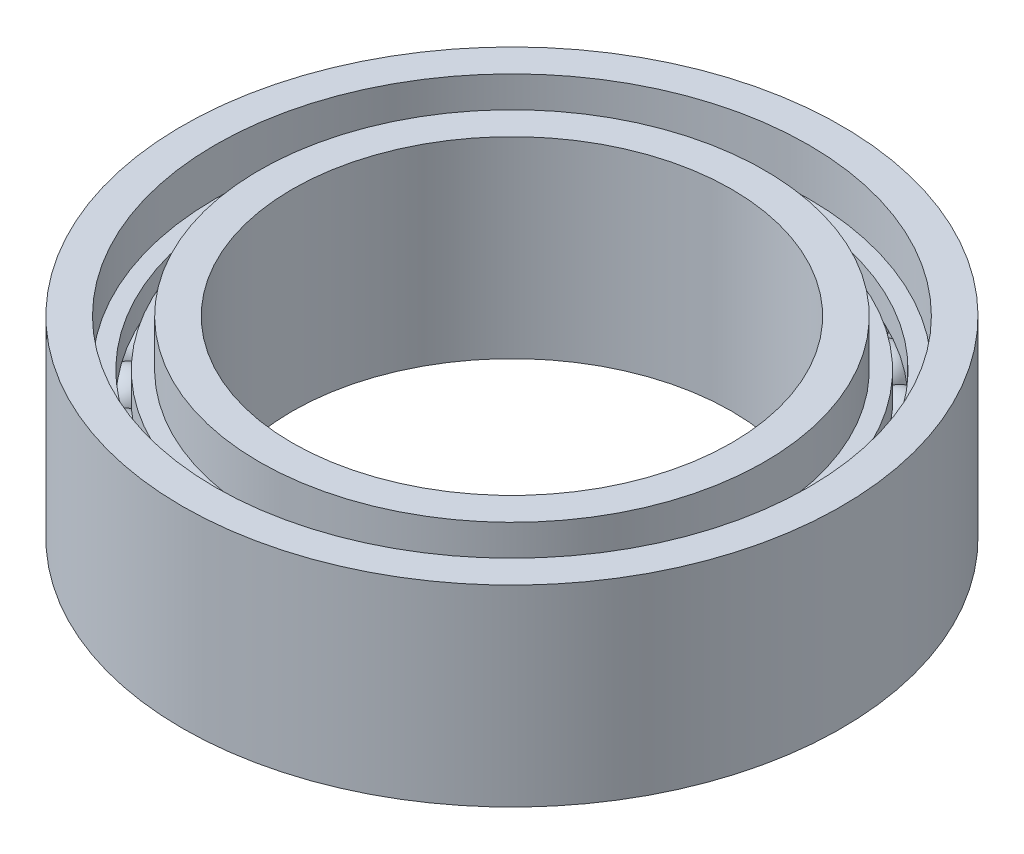
ISO-10303-21;
HEADER;
FILE_DESCRIPTION(('STEP AP214'),'2;1');
FILE_NAME('part.step','',(''),(''),'','','');
FILE_SCHEMA(('AUTOMOTIVE_DESIGN { 1 0 10303 214 1 1 1 1 }'));
ENDSEC;
DATA;
#1=APPLICATION_CONTEXT('core data for automotive mechanical design processes');
#2=APPLICATION_PROTOCOL_DEFINITION('international standard','automotive_design',2000,#1);
#3=PRODUCT_CONTEXT('',#1,'mechanical');
#4=PRODUCT('Part','Part','',(#3));
#5=PRODUCT_RELATED_PRODUCT_CATEGORY('part','',(#4));
#6=PRODUCT_DEFINITION_FORMATION('','',#4);
#7=PRODUCT_DEFINITION_CONTEXT('part definition',#1,'design');
#8=PRODUCT_DEFINITION('design','',#6,#7);
#9=PRODUCT_DEFINITION_SHAPE('','',#8);
#10=(LENGTH_UNIT() NAMED_UNIT(*) SI_UNIT(.MILLI.,.METRE.));
#11=(NAMED_UNIT(*) PLANE_ANGLE_UNIT() SI_UNIT($,.RADIAN.));
#12=(NAMED_UNIT(*) SI_UNIT($,.STERADIAN.) SOLID_ANGLE_UNIT());
#13=UNCERTAINTY_MEASURE_WITH_UNIT(LENGTH_MEASURE(1.E-05),#10,'distance_accuracy_value','');
#14=(GEOMETRIC_REPRESENTATION_CONTEXT(3) GLOBAL_UNCERTAINTY_ASSIGNED_CONTEXT((#13)) GLOBAL_UNIT_ASSIGNED_CONTEXT((#10,
#11,#12)) REPRESENTATION_CONTEXT('',''));
#15=CARTESIAN_POINT('',(0.,0.,0.));
#16=DIRECTION('',(0.,0.,1.));
#17=DIRECTION('',(1.,0.,0.));
#18=AXIS2_PLACEMENT_3D('',#15,#16,#17);
#19=CARTESIAN_POINT('',(-4.89073800366904,1.75,1.03955845408873));
#20=DIRECTION('',(-0.978147600733808,0.,0.207911690817747));
#21=DIRECTION('',(-0.207911690817747,0.,-0.978147600733808));
#22=AXIS2_PLACEMENT_3D('',#19,#20,#21);
#23=SPHERICAL_SURFACE('',#22,0.4);
#24=CARTESIAN_POINT('',(-5.28199704396257,1.75,1.12272313041583));
#25=VERTEX_POINT('',#24);
#26=VERTEX_LOOP('',#25);
#27=FACE_BOUND('',#26,.T.);
#28=ADVANCED_FACE('F63',(#27),#23,.T.);
#29=CLOSED_SHELL('',(#28));
#30=MANIFOLD_SOLID_BREP('B2',#29);
#31=CARTESIAN_POINT('',(-4.56772728821303,1.75,2.03368321537894));
#32=DIRECTION('',(-0.913545457642606,0.,0.406736643075789));
#33=DIRECTION('',(-0.406736643075789,0.,-0.913545457642606));
#34=AXIS2_PLACEMENT_3D('',#31,#32,#33);
#35=SPHERICAL_SURFACE('',#34,0.4);
#36=CARTESIAN_POINT('',(-4.93314547127008,1.75,2.19637787260926));
#37=VERTEX_POINT('',#36);
#38=VERTEX_LOOP('',#37);
#39=FACE_BOUND('',#38,.T.);
#40=ADVANCED_FACE('F83',(#39),#35,.T.);
#41=CLOSED_SHELL('',(#40));
#42=MANIFOLD_SOLID_BREP('B7',#41);
#43=CARTESIAN_POINT('',(-4.04508497187477,1.75,2.93892626146232));
#44=DIRECTION('',(-0.809016994374955,0.,0.587785252292463));
#45=DIRECTION('',(-0.587785252292463,0.,-0.809016994374955));
#46=AXIS2_PLACEMENT_3D('',#43,#44,#45);
#47=SPHERICAL_SURFACE('',#46,0.4);
#48=CARTESIAN_POINT('',(-4.36869176962476,1.75,3.1740403623793));
#49=VERTEX_POINT('',#48);
#50=VERTEX_LOOP('',#49);
#51=FACE_BOUND('',#50,.T.);
#52=ADVANCED_FACE('F103',(#51),#47,.T.);
#53=CLOSED_SHELL('',(#52));
#54=MANIFOLD_SOLID_BREP('B59',#53);
#55=CARTESIAN_POINT('',(-3.34565303179434,1.75,3.71572412738693));
#56=DIRECTION('',(-0.669130606358867,0.,0.743144825477386));
#57=DIRECTION('',(-0.743144825477386,0.,-0.669130606358867));
#58=AXIS2_PLACEMENT_3D('',#55,#56,#57);
#59=SPHERICAL_SURFACE('',#58,0.4);
#60=CARTESIAN_POINT('',(-3.61330527433788,1.75,4.01298205757789));
#61=VERTEX_POINT('',#60);
#62=VERTEX_LOOP('',#61);
#63=FACE_BOUND('',#62,.T.);
#64=ADVANCED_FACE('F123',(#63),#59,.T.);
#65=CLOSED_SHELL('',(#64));
#66=MANIFOLD_SOLID_BREP('B79',#65);
#67=CARTESIAN_POINT('',(-2.50000000000005,1.75,4.33012701892216));
#68=DIRECTION('',(-0.50000000000001,0.,0.866025403784433));
#69=DIRECTION('',(-0.866025403784433,0.,-0.50000000000001));
#70=AXIS2_PLACEMENT_3D('',#67,#68,#69);
#71=SPHERICAL_SURFACE('',#70,0.4);
#72=CARTESIAN_POINT('',(-2.70000000000006,1.75,4.67653718043594));
#73=VERTEX_POINT('',#72);
#74=VERTEX_LOOP('',#73);
#75=FACE_BOUND('',#74,.T.);
#76=ADVANCED_FACE('F143',(#75),#71,.T.);
#77=CLOSED_SHELL('',(#76));
#78=MANIFOLD_SOLID_BREP('B99',#77);
#79=CARTESIAN_POINT('',(-1.54508497187479,1.75,4.75528258147575));
#80=DIRECTION('',(-0.309016994374957,0.,0.95105651629515));
#81=DIRECTION('',(-0.95105651629515,0.,-0.309016994374957));
#82=AXIS2_PLACEMENT_3D('',#79,#80,#81);
#83=SPHERICAL_SURFACE('',#82,0.4);
#84=CARTESIAN_POINT('',(-1.66869176962477,1.75,5.13570518799381));
#85=VERTEX_POINT('',#84);
#86=VERTEX_LOOP('',#85);
#87=FACE_BOUND('',#86,.T.);
#88=ADVANCED_FACE('F163',(#87),#83,.T.);
#89=CLOSED_SHELL('',(#88));
#90=MANIFOLD_SOLID_BREP('B119',#89);
#91=CARTESIAN_POINT('',(-0.522642316338318,1.75,4.97260947684136));
#92=DIRECTION('',(-0.104528463267664,0.,0.994521895368272));
#93=DIRECTION('',(-0.994521895368272,0.,-0.104528463267664));
#94=AXIS2_PLACEMENT_3D('',#91,#92,#93);
#95=SPHERICAL_SURFACE('',#94,0.4);
#96=CARTESIAN_POINT('',(-0.564453701645384,1.75,5.37041823498867));
#97=VERTEX_POINT('',#96);
#98=VERTEX_LOOP('',#97);
#99=FACE_BOUND('',#98,.T.);
#100=ADVANCED_FACE('F183',(#99),#95,.T.);
#101=CLOSED_SHELL('',(#100));
#102=MANIFOLD_SOLID_BREP('B139',#101);
#103=CARTESIAN_POINT('',(0.522642316338218,1.75,4.97260947684137));
#104=DIRECTION('',(0.104528463267644,0.,0.994521895368274));
#105=DIRECTION('',(-0.994521895368274,0.,0.104528463267644));
#106=AXIS2_PLACEMENT_3D('',#103,#104,#105);
#107=SPHERICAL_SURFACE('',#106,0.4);
#108=CARTESIAN_POINT('',(0.564453701645276,1.75,5.37041823498868));
#109=VERTEX_POINT('',#108);
#110=VERTEX_LOOP('',#109);
#111=FACE_BOUND('',#110,.T.);
#112=ADVANCED_FACE('F203',(#111),#107,.T.);
#113=CLOSED_SHELL('',(#112));
#114=MANIFOLD_SOLID_BREP('B159',#113);
#115=CARTESIAN_POINT('',(1.54508497187469,1.75,4.75528258147578));
#116=DIRECTION('',(0.309016994374938,0.,0.951056516295157));
#117=DIRECTION('',(-0.951056516295157,0.,0.309016994374938));
#118=AXIS2_PLACEMENT_3D('',#115,#116,#117);
#119=SPHERICAL_SURFACE('',#118,0.4);
#120=CARTESIAN_POINT('',(1.66869176962467,1.75,5.13570518799385));
#121=VERTEX_POINT('',#120);
#122=VERTEX_LOOP('',#121);
#123=FACE_BOUND('',#122,.T.);
#124=ADVANCED_FACE('F223',(#123),#119,.T.);
#125=CLOSED_SHELL('',(#124));
#126=MANIFOLD_SOLID_BREP('B179',#125);
#127=CARTESIAN_POINT('',(2.49999999999996,1.75,4.33012701892222));
#128=DIRECTION('',(0.499999999999992,0.,0.866025403784443));
#129=DIRECTION('',(-0.866025403784443,0.,0.499999999999992));
#130=AXIS2_PLACEMENT_3D('',#127,#128,#129);
#131=SPHERICAL_SURFACE('',#130,0.4);
#132=CARTESIAN_POINT('',(2.69999999999996,1.75,4.67653718043599));
#133=VERTEX_POINT('',#132);
#134=VERTEX_LOOP('',#133);
#135=FACE_BOUND('',#134,.T.);
#136=ADVANCED_FACE('F243',(#135),#131,.T.);
#137=CLOSED_SHELL('',(#136));
#138=MANIFOLD_SOLID_BREP('B199',#137);
#139=CARTESIAN_POINT('',(3.34565303179426,1.75,3.715724127387));
#140=DIRECTION('',(0.669130606358852,0.,0.7431448254774));
#141=DIRECTION('',(-0.7431448254774,0.,0.669130606358852));
#142=AXIS2_PLACEMENT_3D('',#139,#140,#141);
#143=SPHERICAL_SURFACE('',#142,0.4);
#144=CARTESIAN_POINT('',(3.6133052743378,1.75,4.01298205757796));
#145=VERTEX_POINT('',#144);
#146=VERTEX_LOOP('',#145);
#147=FACE_BOUND('',#146,.T.);
#148=ADVANCED_FACE('F263',(#147),#143,.T.);
#149=CLOSED_SHELL('',(#148));
#150=MANIFOLD_SOLID_BREP('B219',#149);
#151=CARTESIAN_POINT('',(4.04508497187471,1.75,2.9389262614624));
#152=DIRECTION('',(0.809016994374943,0.,0.58778525229248));
#153=DIRECTION('',(-0.58778525229248,0.,0.809016994374943));
#154=AXIS2_PLACEMENT_3D('',#151,#152,#153);
#155=SPHERICAL_SURFACE('',#154,0.4);
#156=CARTESIAN_POINT('',(4.36869176962469,1.75,3.17404036237939));
#157=VERTEX_POINT('',#156);
#158=VERTEX_LOOP('',#157);
#159=FACE_BOUND('',#158,.T.);
#160=ADVANCED_FACE('F285',(#159),#155,.T.);
#161=CLOSED_SHELL('',(#160));
#162=MANIFOLD_SOLID_BREP('B239',#161);
#163=CARTESIAN_POINT('',(4.56772728821299,1.75,2.03368321537904));
#164=DIRECTION('',(0.913545457642598,0.,0.406736643075807));
#165=DIRECTION('',(-0.406736643075807,0.,0.913545457642598));
#166=AXIS2_PLACEMENT_3D('',#163,#164,#165);
#167=SPHERICAL_SURFACE('',#166,0.4);
#168=CARTESIAN_POINT('',(4.20230910515595,1.75,1.87098855814871));
#169=VERTEX_POINT('',#168);
#170=VERTEX_LOOP('',#169);
#171=FACE_BOUND('',#170,.T.);
#172=CARTESIAN_POINT('',(4.93314547127003,1.75,2.19637787260936));
#173=VERTEX_POINT('',#172);
#174=VERTEX_LOOP('',#173);
#175=FACE_BOUND('',#174,.T.);
#176=ADVANCED_FACE('F307',(#171,#175),#167,.T.);
#177=CLOSED_SHELL('',(#176));
#178=MANIFOLD_SOLID_BREP('B259',#177);
#179=CARTESIAN_POINT('',(4.89073800366902,1.75,1.03955845408883));
#180=DIRECTION('',(0.978147600733804,0.,0.207911690817766));
#181=DIRECTION('',(-0.207911690817766,0.,0.978147600733804));
#182=AXIS2_PLACEMENT_3D('',#179,#180,#181);
#183=SPHERICAL_SURFACE('',#182,0.4);
#184=CARTESIAN_POINT('',(4.4994789633755,1.75,0.956393777761726));
#185=VERTEX_POINT('',#184);
#186=VERTEX_LOOP('',#185);
#187=FACE_BOUND('',#186,.T.);
#188=CARTESIAN_POINT('',(5.28199704396254,1.75,1.12272313041594));
#189=VERTEX_POINT('',#188);
#190=VERTEX_LOOP('',#189);
#191=FACE_BOUND('',#190,.T.);
#192=ADVANCED_FACE('F335',(#187,#191),#183,.T.);
#193=CLOSED_SHELL('',(#192));
#194=MANIFOLD_SOLID_BREP('B279',#193);
#195=CARTESIAN_POINT('',(5.,1.75,0.));
#196=DIRECTION('',(1.,0.,0.));
#197=DIRECTION('',(0.,0.,1.));
#198=AXIS2_PLACEMENT_3D('',#195,#196,#197);
#199=SPHERICAL_SURFACE('',#198,0.4);
#200=CARTESIAN_POINT('',(4.6,1.75,0.));
#201=VERTEX_POINT('',#200);
#202=VERTEX_LOOP('',#201);
#203=FACE_BOUND('',#202,.T.);
#204=CARTESIAN_POINT('',(5.4,1.75,0.));
#205=VERTEX_POINT('',#204);
#206=VERTEX_LOOP('',#205);
#207=FACE_BOUND('',#206,.T.);
#208=ADVANCED_FACE('F363',(#203,#207),#199,.T.);
#209=CLOSED_SHELL('',(#208));
#210=MANIFOLD_SOLID_BREP('B301',#209);
#211=CARTESIAN_POINT('',(4.89073800366903,1.75,-1.03955845408877));
#212=DIRECTION('',(0.978147600733807,0.,-0.207911690817753));
#213=DIRECTION('',(0.207911690817753,0.,0.978147600733807));
#214=AXIS2_PLACEMENT_3D('',#211,#212,#213);
#215=SPHERICAL_SURFACE('',#214,0.4);
#216=CARTESIAN_POINT('',(4.49947896337551,1.75,-0.956393777761665));
#217=VERTEX_POINT('',#216);
#218=VERTEX_LOOP('',#217);
#219=FACE_BOUND('',#218,.T.);
#220=CARTESIAN_POINT('',(5.28199704396256,1.75,-1.12272313041587));
#221=VERTEX_POINT('',#220);
#222=VERTEX_LOOP('',#221);
#223=FACE_BOUND('',#222,.T.);
#224=ADVANCED_FACE('F391',(#219,#223),#215,.T.);
#225=CLOSED_SHELL('',(#224));
#226=MANIFOLD_SOLID_BREP('B329',#225);
#227=CARTESIAN_POINT('',(4.56772728821302,1.75,-2.03368321537897));
#228=DIRECTION('',(0.913545457642603,0.,-0.406736643075795));
#229=DIRECTION('',(0.406736643075795,0.,0.913545457642603));
#230=AXIS2_PLACEMENT_3D('',#227,#228,#229);
#231=SPHERICAL_SURFACE('',#230,0.4);
#232=CARTESIAN_POINT('',(4.20230910515598,1.75,-1.87098855814866));
#233=VERTEX_POINT('',#232);
#234=VERTEX_LOOP('',#233);
#235=FACE_BOUND('',#234,.T.);
#236=CARTESIAN_POINT('',(4.93314547127006,1.75,-2.19637787260929));
#237=VERTEX_POINT('',#236);
#238=VERTEX_LOOP('',#237);
#239=FACE_BOUND('',#238,.T.);
#240=ADVANCED_FACE('F419',(#235,#239),#231,.T.);
#241=CLOSED_SHELL('',(#240));
#242=MANIFOLD_SOLID_BREP('B357',#241);
#243=CARTESIAN_POINT('',(4.04508497187475,1.75,-2.93892626146235));
#244=DIRECTION('',(0.80901699437495,0.,-0.587785252292469));
#245=DIRECTION('',(0.587785252292469,0.,0.80901699437495));
#246=AXIS2_PLACEMENT_3D('',#243,#244,#245);
#247=SPHERICAL_SURFACE('',#246,0.4);
#248=CARTESIAN_POINT('',(3.72147817412477,1.75,-2.70381216054536));
#249=VERTEX_POINT('',#248);
#250=VERTEX_LOOP('',#249);
#251=FACE_BOUND('',#250,.T.);
#252=CARTESIAN_POINT('',(4.36869176962473,1.75,-3.17404036237933));
#253=VERTEX_POINT('',#252);
#254=VERTEX_LOOP('',#253);
#255=FACE_BOUND('',#254,.T.);
#256=ADVANCED_FACE('F447',(#251,#255),#247,.T.);
#257=CLOSED_SHELL('',(#256));
#258=MANIFOLD_SOLID_BREP('B385',#257);
#259=CARTESIAN_POINT('',(3.34565303179431,1.75,-3.71572412738696));
#260=DIRECTION('',(0.669130606358862,0.,-0.743144825477391));
#261=DIRECTION('',(0.743144825477391,0.,0.669130606358862));
#262=AXIS2_PLACEMENT_3D('',#259,#260,#261);
#263=SPHERICAL_SURFACE('',#262,0.4);
#264=CARTESIAN_POINT('',(3.07800078925077,1.75,-3.418466197196));
#265=VERTEX_POINT('',#264);
#266=VERTEX_LOOP('',#265);
#267=FACE_BOUND('',#266,.T.);
#268=CARTESIAN_POINT('',(3.61330527433786,1.75,-4.01298205757791));
#269=VERTEX_POINT('',#268);
#270=VERTEX_LOOP('',#269);
#271=FACE_BOUND('',#270,.T.);
#272=ADVANCED_FACE('F475',(#267,#271),#263,.T.);
#273=CLOSED_SHELL('',(#272));
#274=MANIFOLD_SOLID_BREP('B413',#273);
#275=CARTESIAN_POINT('',(2.50000000000002,1.75,-4.33012701892218));
#276=DIRECTION('',(0.500000000000004,0.,-0.866025403784436));
#277=DIRECTION('',(0.866025403784436,0.,0.500000000000004));
#278=AXIS2_PLACEMENT_3D('',#275,#276,#277);
#279=SPHERICAL_SURFACE('',#278,0.4);
#280=CARTESIAN_POINT('',(2.30000000000002,1.75,-3.98371685740841));
#281=VERTEX_POINT('',#280);
#282=VERTEX_LOOP('',#281);
#283=FACE_BOUND('',#282,.T.);
#284=CARTESIAN_POINT('',(2.70000000000002,1.75,-4.67653718043596));
#285=VERTEX_POINT('',#284);
#286=VERTEX_LOOP('',#285);
#287=FACE_BOUND('',#286,.T.);
#288=ADVANCED_FACE('F503',(#283,#287),#279,.T.);
#289=CLOSED_SHELL('',(#288));
#290=MANIFOLD_SOLID_BREP('B441',#289);
#291=CARTESIAN_POINT('',(1.54508497187476,1.75,-4.75528258147576));
#292=DIRECTION('',(0.309016994374951,0.,-0.951056516295152));
#293=DIRECTION('',(0.951056516295152,0.,0.309016994374951));
#294=AXIS2_PLACEMENT_3D('',#291,#292,#293);
#295=SPHERICAL_SURFACE('',#294,0.4);
#296=CARTESIAN_POINT('',(1.42147817412478,1.75,-4.3748599749577));
#297=VERTEX_POINT('',#296);
#298=VERTEX_LOOP('',#297);
#299=FACE_BOUND('',#298,.T.);
#300=CARTESIAN_POINT('',(1.66869176962474,1.75,-5.13570518799382));
#301=VERTEX_POINT('',#300);
#302=VERTEX_LOOP('',#301);
#303=FACE_BOUND('',#302,.T.);
#304=ADVANCED_FACE('F531',(#299,#303),#295,.T.);
#305=CLOSED_SHELL('',(#304));
#306=MANIFOLD_SOLID_BREP('B469',#305);
#307=CARTESIAN_POINT('',(0.522642316338286,1.75,-4.97260947684137));
#308=DIRECTION('',(0.104528463267657,0.,-0.994521895368273));
#309=DIRECTION('',(0.994521895368273,0.,0.104528463267657));
#310=AXIS2_PLACEMENT_3D('',#307,#308,#309);
#311=SPHERICAL_SURFACE('',#310,0.4);
#312=CARTESIAN_POINT('',(0.480830931031223,1.75,-4.57480071869406));
#313=VERTEX_POINT('',#312);
#314=VERTEX_LOOP('',#313);
#315=FACE_BOUND('',#314,.T.);
#316=CARTESIAN_POINT('',(0.564453701645348,1.75,-5.37041823498868));
#317=VERTEX_POINT('',#316);
#318=VERTEX_LOOP('',#317);
#319=FACE_BOUND('',#318,.T.);
#320=ADVANCED_FACE('F559',(#315,#319),#311,.T.);
#321=CLOSED_SHELL('',(#320));
#322=MANIFOLD_SOLID_BREP('B497',#321);
#323=CARTESIAN_POINT('',(-0.522642316338252,1.75,-4.97260947684137));
#324=DIRECTION('',(-0.10452846326765,0.,-0.994521895368274));
#325=DIRECTION('',(0.994521895368274,0.,-0.10452846326765));
#326=AXIS2_PLACEMENT_3D('',#323,#324,#325);
#327=SPHERICAL_SURFACE('',#326,0.4);
#328=CARTESIAN_POINT('',(-0.480830931031192,1.75,-4.57480071869406));
#329=VERTEX_POINT('',#328);
#330=VERTEX_LOOP('',#329);
#331=FACE_BOUND('',#330,.T.);
#332=CARTESIAN_POINT('',(-0.564453701645312,1.75,-5.37041823498868));
#333=VERTEX_POINT('',#332);
#334=VERTEX_LOOP('',#333);
#335=FACE_BOUND('',#334,.T.);
#336=ADVANCED_FACE('F587',(#331,#335),#327,.T.);
#337=CLOSED_SHELL('',(#336));
#338=MANIFOLD_SOLID_BREP('B525',#337);
#339=CARTESIAN_POINT('',(-1.54508497187473,1.75,-4.75528258147577));
#340=DIRECTION('',(-0.309016994374945,0.,-0.951056516295154));
#341=DIRECTION('',(0.951056516295154,0.,-0.309016994374945));
#342=AXIS2_PLACEMENT_3D('',#339,#340,#341);
#343=SPHERICAL_SURFACE('',#342,0.4);
#344=CARTESIAN_POINT('',(-1.42147817412475,1.75,-4.37485997495771));
#345=VERTEX_POINT('',#344);
#346=VERTEX_LOOP('',#345);
#347=FACE_BOUND('',#346,.T.);
#348=CARTESIAN_POINT('',(-1.6686917696247,1.75,-5.13570518799384));
#349=VERTEX_POINT('',#348);
#350=VERTEX_LOOP('',#349);
#351=FACE_BOUND('',#350,.T.);
#352=ADVANCED_FACE('F615',(#347,#351),#343,.T.);
#353=CLOSED_SHELL('',(#352));
#354=MANIFOLD_SOLID_BREP('B553',#353);
#355=CARTESIAN_POINT('',(-2.49999999999999,1.75,-4.3301270189222));
#356=DIRECTION('',(-0.499999999999998,0.,-0.86602540378444));
#357=DIRECTION('',(0.86602540378444,0.,-0.499999999999998));
#358=AXIS2_PLACEMENT_3D('',#355,#356,#357);
#359=SPHERICAL_SURFACE('',#358,0.4);
#360=CARTESIAN_POINT('',(-2.29999999999999,1.75,-3.98371685740842));
#361=VERTEX_POINT('',#360);
#362=VERTEX_LOOP('',#361);
#363=FACE_BOUND('',#362,.T.);
#364=CARTESIAN_POINT('',(-2.69999999999999,1.75,-4.67653718043598));
#365=VERTEX_POINT('',#364);
#366=VERTEX_LOOP('',#365);
#367=FACE_BOUND('',#366,.T.);
#368=ADVANCED_FACE('F643',(#363,#367),#359,.T.);
#369=CLOSED_SHELL('',(#368));
#370=MANIFOLD_SOLID_BREP('B581',#369);
#371=CARTESIAN_POINT('',(-3.34565303179428,1.75,-3.71572412738698));
#372=DIRECTION('',(-0.669130606358857,0.,-0.743144825477395));
#373=DIRECTION('',(0.743144825477395,0.,-0.669130606358857));
#374=AXIS2_PLACEMENT_3D('',#371,#372,#373);
#375=SPHERICAL_SURFACE('',#374,0.4);
#376=CARTESIAN_POINT('',(-3.07800078925074,1.75,-3.41846619719602));
#377=VERTEX_POINT('',#376);
#378=VERTEX_LOOP('',#377);
#379=FACE_BOUND('',#378,.T.);
#380=CARTESIAN_POINT('',(-3.61330527433783,1.75,-4.01298205757794));
#381=VERTEX_POINT('',#380);
#382=VERTEX_LOOP('',#381);
#383=FACE_BOUND('',#382,.T.);
#384=ADVANCED_FACE('F671',(#379,#383),#375,.T.);
#385=CLOSED_SHELL('',(#384));
#386=MANIFOLD_SOLID_BREP('B609',#385);
#387=CARTESIAN_POINT('',(-4.04508497187473,1.75,-2.93892626146237));
#388=DIRECTION('',(-0.809016994374947,0.,-0.587785252292474));
#389=DIRECTION('',(0.587785252292474,0.,-0.809016994374947));
#390=AXIS2_PLACEMENT_3D('',#387,#388,#389);
#391=SPHERICAL_SURFACE('',#390,0.4);
#392=CARTESIAN_POINT('',(-3.72147817412476,1.75,-2.70381216054538));
#393=VERTEX_POINT('',#392);
#394=VERTEX_LOOP('',#393);
#395=FACE_BOUND('',#394,.T.);
#396=CARTESIAN_POINT('',(-4.36869176962471,1.75,-3.17404036237936));
#397=VERTEX_POINT('',#396);
#398=VERTEX_LOOP('',#397);
#399=FACE_BOUND('',#398,.T.);
#400=ADVANCED_FACE('F699',(#395,#399),#391,.T.);
#401=CLOSED_SHELL('',(#400));
#402=MANIFOLD_SOLID_BREP('B637',#401);
#403=CARTESIAN_POINT('',(-4.567727288213,1.75,-2.03368321537901));
#404=DIRECTION('',(-0.913545457642601,0.,-0.406736643075801));
#405=DIRECTION('',(0.406736643075801,0.,-0.913545457642601));
#406=AXIS2_PLACEMENT_3D('',#403,#404,#405);
#407=SPHERICAL_SURFACE('',#406,0.4);
#408=CARTESIAN_POINT('',(-4.20230910515596,1.75,-1.87098855814868));
#409=VERTEX_POINT('',#408);
#410=VERTEX_LOOP('',#409);
#411=FACE_BOUND('',#410,.T.);
#412=CARTESIAN_POINT('',(-4.93314547127004,1.75,-2.19637787260933));
#413=VERTEX_POINT('',#412);
#414=VERTEX_LOOP('',#413);
#415=FACE_BOUND('',#414,.T.);
#416=ADVANCED_FACE('F727',(#411,#415),#407,.T.);
#417=CLOSED_SHELL('',(#416));
#418=MANIFOLD_SOLID_BREP('B665',#417);
#419=CARTESIAN_POINT('',(-4.89073800366903,1.75,-1.0395584540888));
#420=DIRECTION('',(-0.978147600733806,0.,-0.20791169081776));
#421=DIRECTION('',(0.20791169081776,0.,-0.978147600733806));
#422=AXIS2_PLACEMENT_3D('',#419,#420,#421);
#423=SPHERICAL_SURFACE('',#422,0.4);
#424=CARTESIAN_POINT('',(-4.49947896337551,1.75,-0.956393777761695));
#425=VERTEX_POINT('',#424);
#426=VERTEX_LOOP('',#425);
#427=FACE_BOUND('',#426,.T.);
#428=CARTESIAN_POINT('',(-5.28199704396255,1.75,-1.1227231304159));
#429=VERTEX_POINT('',#428);
#430=VERTEX_LOOP('',#429);
#431=FACE_BOUND('',#430,.T.);
#432=ADVANCED_FACE('F755',(#427,#431),#423,.T.);
#433=CLOSED_SHELL('',(#432));
#434=MANIFOLD_SOLID_BREP('B693',#433);
#435=CARTESIAN_POINT('',(-5.,1.75,0.));
#436=DIRECTION('',(-1.,0.,0.));
#437=DIRECTION('',(0.,0.,-1.));
#438=AXIS2_PLACEMENT_3D('',#435,#436,#437);
#439=SPHERICAL_SURFACE('',#438,0.4);
#440=CARTESIAN_POINT('',(-4.6,1.75,0.));
#441=VERTEX_POINT('',#440);
#442=VERTEX_LOOP('',#441);
#443=FACE_BOUND('',#442,.T.);
#444=CARTESIAN_POINT('',(-5.4,1.75,0.));
#445=VERTEX_POINT('',#444);
#446=VERTEX_LOOP('',#445);
#447=FACE_BOUND('',#446,.T.);
#448=ADVANCED_FACE('F785',(#443,#447),#439,.T.);
#449=CLOSED_SHELL('',(#448));
#450=MANIFOLD_SOLID_BREP('B721',#449);
#451=CARTESIAN_POINT('',(0.,3.5,0.));
#452=DIRECTION('',(0.,-1.,0.));
#453=DIRECTION('',(0.,0.,-1.));
#454=AXIS2_PLACEMENT_3D('',#451,#452,#453);
#455=CYLINDRICAL_SURFACE('',#454,4.6);
#456=CARTESIAN_POINT('',(0.,2.15,0.));
#457=DIRECTION('',(0.,1.,0.));
#458=DIRECTION('',(0.,0.,1.));
#459=AXIS2_PLACEMENT_3D('',#456,#457,#458);
#460=CIRCLE('',#459,4.6);
#461=CARTESIAN_POINT('',(0.,2.15,4.6));
#462=VERTEX_POINT('',#461);
#463=EDGE_CURVE('E822',#462,#462,#460,.T.);
#464=ORIENTED_EDGE('',*,*,#463,.F.);
#465=EDGE_LOOP('',(#464));
#466=FACE_BOUND('',#465,.T.);
#467=CARTESIAN_POINT('',(3.72147817412474,1.75,2.70381216054541));
#468=VERTEX_POINT('',#467);
#469=VERTEX_LOOP('',#468);
#470=FACE_BOUND('',#469,.T.);
#471=CARTESIAN_POINT('',(3.07800078925072,1.75,3.41846619719604));
#472=VERTEX_POINT('',#471);
#473=VERTEX_LOOP('',#472);
#474=FACE_BOUND('',#473,.T.);
#475=CARTESIAN_POINT('',(2.29999999999996,1.75,3.98371685740844));
#476=VERTEX_POINT('',#475);
#477=VERTEX_LOOP('',#476);
#478=FACE_BOUND('',#477,.T.);
#479=CARTESIAN_POINT('',(1.42147817412472,1.75,4.37485997495772));
#480=VERTEX_POINT('',#479);
#481=VERTEX_LOOP('',#480);
#482=FACE_BOUND('',#481,.T.);
#483=CARTESIAN_POINT('',(0.480830931031161,1.75,4.57480071869406));
#484=VERTEX_POINT('',#483);
#485=VERTEX_LOOP('',#484);
#486=FACE_BOUND('',#485,.T.);
#487=CARTESIAN_POINT('',(-0.480830931031252,1.75,4.57480071869405));
#488=VERTEX_POINT('',#487);
#489=VERTEX_LOOP('',#488);
#490=FACE_BOUND('',#489,.T.);
#491=CARTESIAN_POINT('',(-1.4214781741248,1.75,4.37485997495769));
#492=VERTEX_POINT('',#491);
#493=VERTEX_LOOP('',#492);
#494=FACE_BOUND('',#493,.T.);
#495=CARTESIAN_POINT('',(-2.30000000000005,1.75,3.98371685740839));
#496=VERTEX_POINT('',#495);
#497=VERTEX_LOOP('',#496);
#498=FACE_BOUND('',#497,.T.);
#499=CARTESIAN_POINT('',(-3.07800078925079,1.75,3.41846619719598));
#500=VERTEX_POINT('',#499);
#501=VERTEX_LOOP('',#500);
#502=FACE_BOUND('',#501,.T.);
#503=CARTESIAN_POINT('',(-3.72147817412479,1.75,2.70381216054533));
#504=VERTEX_POINT('',#503);
#505=VERTEX_LOOP('',#504);
#506=FACE_BOUND('',#505,.T.);
#507=CARTESIAN_POINT('',(-4.20230910515599,1.75,1.87098855814863));
#508=VERTEX_POINT('',#507);
#509=VERTEX_LOOP('',#508);
#510=FACE_BOUND('',#509,.T.);
#511=CARTESIAN_POINT('',(-4.49947896337552,1.75,0.956393777761636));
#512=VERTEX_POINT('',#511);
#513=VERTEX_LOOP('',#512);
#514=FACE_BOUND('',#513,.T.);
#515=CARTESIAN_POINT('',(0.,1.35,0.));
#516=DIRECTION('',(0.,-1.,0.));
#517=DIRECTION('',(0.,0.,-1.));
#518=AXIS2_PLACEMENT_3D('',#515,#516,#517);
#519=CIRCLE('',#518,4.6);
#520=CARTESIAN_POINT('',(0.,1.35,-4.6));
#521=VERTEX_POINT('',#520);
#522=EDGE_CURVE('E783',#521,#521,#519,.T.);
#523=ORIENTED_EDGE('',*,*,#522,.F.);
#524=EDGE_LOOP('',(#523));
#525=FACE_BOUND('',#524,.T.);
#526=ADVANCED_FACE('F814',(#466,#470,#474,#478,#482,#486,#490,#494,#498,#502,#506,#510,#514,
#525),#455,.T.);
#527=CARTESIAN_POINT('',(0.,0.85,0.));
#528=DIRECTION('',(0.,-1.,0.));
#529=DIRECTION('',(0.,0.,-1.));
#530=AXIS2_PLACEMENT_3D('',#527,#528,#529);
#531=CIRCLE('',#530,4.6);
#532=CARTESIAN_POINT('',(0.,0.85,-4.6));
#533=VERTEX_POINT('',#532);
#534=EDGE_CURVE('E884',#533,#533,#531,.T.);
#535=ORIENTED_EDGE('',*,*,#534,.T.);
#536=EDGE_LOOP('',(#535));
#537=FACE_BOUND('',#536,.T.);
#538=CARTESIAN_POINT('',(0.,0.,0.));
#539=DIRECTION('',(0.,1.,0.));
#540=DIRECTION('',(0.,0.,1.));
#541=AXIS2_PLACEMENT_3D('',#538,#539,#540);
#542=CIRCLE('',#541,4.6);
#543=CARTESIAN_POINT('',(0.,0.,4.6));
#544=VERTEX_POINT('',#543);
#545=EDGE_CURVE('E905',#544,#544,#542,.T.);
#546=ORIENTED_EDGE('',*,*,#545,.T.);
#547=EDGE_LOOP('',(#546));
#548=FACE_BOUND('',#547,.T.);
#549=ADVANCED_FACE('F861',(#537,#548),#455,.T.);
#550=CARTESIAN_POINT('',(0.,3.5,0.));
#551=DIRECTION('',(0.,-1.,0.));
#552=DIRECTION('',(0.,0.,-1.));
#553=AXIS2_PLACEMENT_3D('',#550,#551,#552);
#554=CYLINDRICAL_SURFACE('',#553,4.);
#555=CARTESIAN_POINT('',(0.,3.5,0.));
#556=DIRECTION('',(0.,1.,0.));
#557=DIRECTION('',(0.,0.,1.));
#558=AXIS2_PLACEMENT_3D('',#555,#556,#557);
#559=CIRCLE('',#558,4.);
#560=CARTESIAN_POINT('',(0.,3.5,4.));
#561=VERTEX_POINT('',#560);
#562=EDGE_CURVE('E901',#561,#561,#559,.T.);
#563=ORIENTED_EDGE('',*,*,#562,.T.);
#564=EDGE_LOOP('',(#563));
#565=FACE_BOUND('',#564,.T.);
#566=CARTESIAN_POINT('',(0.,0.,0.));
#567=DIRECTION('',(0.,1.,0.));
#568=DIRECTION('',(0.,0.,1.));
#569=AXIS2_PLACEMENT_3D('',#566,#567,#568);
#570=CIRCLE('',#569,4.);
#571=CARTESIAN_POINT('',(0.,0.,4.));
#572=VERTEX_POINT('',#571);
#573=EDGE_CURVE('E898',#572,#572,#570,.T.);
#574=ORIENTED_EDGE('',*,*,#573,.F.);
#575=EDGE_LOOP('',(#574));
#576=FACE_BOUND('',#575,.T.);
#577=ADVANCED_FACE('F816',(#565,#576),#554,.F.);
#578=CARTESIAN_POINT('',(0.,2.65,0.));
#579=DIRECTION('',(0.,1.,0.));
#580=DIRECTION('',(0.,0.,1.));
#581=AXIS2_PLACEMENT_3D('',#578,#579,#580);
#582=CIRCLE('',#581,4.6);
#583=CARTESIAN_POINT('',(0.,2.65,4.6));
#584=VERTEX_POINT('',#583);
#585=EDGE_CURVE('E891',#584,#584,#582,.T.);
#586=ORIENTED_EDGE('',*,*,#585,.T.);
#587=EDGE_LOOP('',(#586));
#588=FACE_BOUND('',#587,.T.);
#589=CARTESIAN_POINT('',(0.,3.5,0.));
#590=DIRECTION('',(0.,1.,0.));
#591=DIRECTION('',(0.,0.,1.));
#592=AXIS2_PLACEMENT_3D('',#589,#590,#591);
#593=CIRCLE('',#592,4.6);
#594=CARTESIAN_POINT('',(0.,3.5,4.6));
#595=VERTEX_POINT('',#594);
#596=EDGE_CURVE('E904',#595,#595,#593,.T.);
#597=ORIENTED_EDGE('',*,*,#596,.F.);
#598=EDGE_LOOP('',(#597));
#599=FACE_BOUND('',#598,.T.);
#600=ADVANCED_FACE('F863',(#588,#599),#455,.T.);
#601=CARTESIAN_POINT('',(0.,3.5,0.));
#602=DIRECTION('',(0.,1.,0.));
#603=DIRECTION('',(0.,0.,1.));
#604=AXIS2_PLACEMENT_3D('',#601,#602,#603);
#605=PLANE('',#604);
#606=ORIENTED_EDGE('',*,*,#562,.F.);
#607=EDGE_LOOP('',(#606));
#608=FACE_BOUND('',#607,.T.);
#609=ORIENTED_EDGE('',*,*,#596,.T.);
#610=EDGE_LOOP('',(#609));
#611=FACE_BOUND('',#610,.T.);
#612=ADVANCED_FACE('F933',(#608,#611),#605,.T.);
#613=CARTESIAN_POINT('',(0.,0.,0.));
#614=DIRECTION('',(0.,1.,0.));
#615=DIRECTION('',(0.,0.,1.));
#616=AXIS2_PLACEMENT_3D('',#613,#614,#615);
#617=PLANE('',#616);
#618=ORIENTED_EDGE('',*,*,#573,.T.);
#619=EDGE_LOOP('',(#618));
#620=FACE_BOUND('',#619,.T.);
#621=ORIENTED_EDGE('',*,*,#545,.F.);
#622=EDGE_LOOP('',(#621));
#623=FACE_BOUND('',#622,.T.);
#624=ADVANCED_FACE('F924',(#620,#623),#617,.F.);
#625=CARTESIAN_POINT('',(0.,2.65,0.));
#626=DIRECTION('',(0.,-1.,0.));
#627=DIRECTION('',(0.,0.,-1.));
#628=AXIS2_PLACEMENT_3D('',#625,#626,#627);
#629=CYLINDRICAL_SURFACE('',#628,4.9);
#630=CARTESIAN_POINT('',(0.,2.65,0.));
#631=DIRECTION('',(0.,1.,0.));
#632=DIRECTION('',(0.,0.,1.));
#633=AXIS2_PLACEMENT_3D('',#630,#631,#632);
#634=CIRCLE('',#633,4.9);
#635=CARTESIAN_POINT('',(0.,2.65,4.9));
#636=VERTEX_POINT('',#635);
#637=EDGE_CURVE('E894',#636,#636,#634,.T.);
#638=ORIENTED_EDGE('',*,*,#637,.F.);
#639=EDGE_LOOP('',(#638));
#640=FACE_BOUND('',#639,.T.);
#641=CARTESIAN_POINT('',(0.,2.15,0.));
#642=DIRECTION('',(0.,1.,0.));
#643=DIRECTION('',(0.,0.,1.));
#644=AXIS2_PLACEMENT_3D('',#641,#642,#643);
#645=CIRCLE('',#644,4.9);
#646=CARTESIAN_POINT('',(0.,2.15,4.9));
#647=VERTEX_POINT('',#646);
#648=EDGE_CURVE('E895',#647,#647,#645,.T.);
#649=ORIENTED_EDGE('',*,*,#648,.T.);
#650=EDGE_LOOP('',(#649));
#651=FACE_BOUND('',#650,.T.);
#652=ADVANCED_FACE('F922',(#640,#651),#629,.T.);
#653=CARTESIAN_POINT('',(0.,2.65,0.));
#654=DIRECTION('',(0.,1.,0.));
#655=DIRECTION('',(0.,0.,1.));
#656=AXIS2_PLACEMENT_3D('',#653,#654,#655);
#657=PLANE('',#656);
#658=ORIENTED_EDGE('',*,*,#585,.F.);
#659=EDGE_LOOP('',(#658));
#660=FACE_BOUND('',#659,.T.);
#661=ORIENTED_EDGE('',*,*,#637,.T.);
#662=EDGE_LOOP('',(#661));
#663=FACE_BOUND('',#662,.T.);
#664=ADVANCED_FACE('F918',(#660,#663),#657,.T.);
#665=CARTESIAN_POINT('',(0.,2.15,0.));
#666=DIRECTION('',(0.,1.,0.));
#667=DIRECTION('',(0.,0.,1.));
#668=AXIS2_PLACEMENT_3D('',#665,#666,#667);
#669=PLANE('',#668);
#670=ORIENTED_EDGE('',*,*,#463,.T.);
#671=EDGE_LOOP('',(#670));
#672=FACE_BOUND('',#671,.T.);
#673=ORIENTED_EDGE('',*,*,#648,.F.);
#674=EDGE_LOOP('',(#673));
#675=FACE_BOUND('',#674,.T.);
#676=ADVANCED_FACE('F914',(#672,#675),#669,.F.);
#677=CARTESIAN_POINT('',(0.,0.85,0.));
#678=DIRECTION('',(0.,1.,0.));
#679=DIRECTION('',(0.,0.,1.));
#680=AXIS2_PLACEMENT_3D('',#677,#678,#679);
#681=CYLINDRICAL_SURFACE('',#680,4.9);
#682=CARTESIAN_POINT('',(0.,0.85,0.));
#683=DIRECTION('',(0.,-1.,0.));
#684=DIRECTION('',(0.,0.,-1.));
#685=AXIS2_PLACEMENT_3D('',#682,#683,#684);
#686=CIRCLE('',#685,4.9);
#687=CARTESIAN_POINT('',(0.,0.85,-4.9));
#688=VERTEX_POINT('',#687);
#689=EDGE_CURVE('E887',#688,#688,#686,.T.);
#690=ORIENTED_EDGE('',*,*,#689,.F.);
#691=EDGE_LOOP('',(#690));
#692=FACE_BOUND('',#691,.T.);
#693=CARTESIAN_POINT('',(0.,1.35,0.));
#694=DIRECTION('',(0.,-1.,0.));
#695=DIRECTION('',(0.,0.,-1.));
#696=AXIS2_PLACEMENT_3D('',#693,#694,#695);
#697=CIRCLE('',#696,4.9);
#698=CARTESIAN_POINT('',(0.,1.35,-4.9));
#699=VERTEX_POINT('',#698);
#700=EDGE_CURVE('E882',#699,#699,#697,.T.);
#701=ORIENTED_EDGE('',*,*,#700,.T.);
#702=EDGE_LOOP('',(#701));
#703=FACE_BOUND('',#702,.T.);
#704=ADVANCED_FACE('F917',(#692,#703),#681,.T.);
#705=CARTESIAN_POINT('',(0.,0.85,0.));
#706=DIRECTION('',(0.,-1.,0.));
#707=DIRECTION('',(0.,0.,-1.));
#708=AXIS2_PLACEMENT_3D('',#705,#706,#707);
#709=PLANE('',#708);
#710=ORIENTED_EDGE('',*,*,#534,.F.);
#711=EDGE_LOOP('',(#710));
#712=FACE_BOUND('',#711,.T.);
#713=ORIENTED_EDGE('',*,*,#689,.T.);
#714=EDGE_LOOP('',(#713));
#715=FACE_BOUND('',#714,.T.);
#716=ADVANCED_FACE('F878',(#712,#715),#709,.T.);
#717=CARTESIAN_POINT('',(0.,1.35,0.));
#718=DIRECTION('',(0.,-1.,0.));
#719=DIRECTION('',(0.,0.,-1.));
#720=AXIS2_PLACEMENT_3D('',#717,#718,#719);
#721=PLANE('',#720);
#722=ORIENTED_EDGE('',*,*,#522,.T.);
#723=EDGE_LOOP('',(#722));
#724=FACE_BOUND('',#723,.T.);
#725=ORIENTED_EDGE('',*,*,#700,.F.);
#726=EDGE_LOOP('',(#725));
#727=FACE_BOUND('',#726,.T.);
#728=ADVANCED_FACE('F875',(#724,#727),#721,.F.);
#729=CLOSED_SHELL('',(#526,#549,#577,#600,#612,#624,#652,#664,#676,#704,#716,#728));
#730=MANIFOLD_SOLID_BREP('B749',#729);
#731=CARTESIAN_POINT('',(0.,3.5,0.));
#732=DIRECTION('',(0.,-1.,0.));
#733=DIRECTION('',(0.,0.,-1.));
#734=AXIS2_PLACEMENT_3D('',#731,#732,#733);
#735=CYLINDRICAL_SURFACE('',#734,5.4);
#736=CARTESIAN_POINT('',(0.,2.15,0.));
#737=DIRECTION('',(0.,1.,0.));
#738=DIRECTION('',(0.,0.,1.));
#739=AXIS2_PLACEMENT_3D('',#736,#737,#738);
#740=CIRCLE('',#739,5.4);
#741=CARTESIAN_POINT('',(0.,2.15,5.4));
#742=VERTEX_POINT('',#741);
#743=EDGE_CURVE('E1138',#742,#742,#740,.T.);
#744=ORIENTED_EDGE('',*,*,#743,.T.);
#745=EDGE_LOOP('',(#744));
#746=FACE_BOUND('',#745,.T.);
#747=CARTESIAN_POINT('',(4.36869176962469,1.75,3.17404036237939));
#748=VERTEX_POINT('',#747);
#749=VERTEX_LOOP('',#748);
#750=FACE_BOUND('',#749,.T.);
#751=CARTESIAN_POINT('',(3.6133052743378,1.75,4.01298205757796));
#752=VERTEX_POINT('',#751);
#753=VERTEX_LOOP('',#752);
#754=FACE_BOUND('',#753,.T.);
#755=CARTESIAN_POINT('',(2.69999999999996,1.75,4.67653718043599));
#756=VERTEX_POINT('',#755);
#757=VERTEX_LOOP('',#756);
#758=FACE_BOUND('',#757,.T.);
#759=CARTESIAN_POINT('',(1.66869176962467,1.75,5.13570518799385));
#760=VERTEX_POINT('',#759);
#761=VERTEX_LOOP('',#760);
#762=FACE_BOUND('',#761,.T.);
#763=CARTESIAN_POINT('',(0.564453701645276,1.75,5.37041823498868));
#764=VERTEX_POINT('',#763);
#765=VERTEX_LOOP('',#764);
#766=FACE_BOUND('',#765,.T.);
#767=CARTESIAN_POINT('',(-0.564453701645383,1.75,5.37041823498867));
#768=VERTEX_POINT('',#767);
#769=VERTEX_LOOP('',#768);
#770=FACE_BOUND('',#769,.T.);
#771=CARTESIAN_POINT('',(-1.66869176962477,1.75,5.13570518799381));
#772=VERTEX_POINT('',#771);
#773=VERTEX_LOOP('',#772);
#774=FACE_BOUND('',#773,.T.);
#775=CARTESIAN_POINT('',(-2.70000000000006,1.75,4.67653718043594));
#776=VERTEX_POINT('',#775);
#777=VERTEX_LOOP('',#776);
#778=FACE_BOUND('',#777,.T.);
#779=CARTESIAN_POINT('',(-3.61330527433788,1.75,4.01298205757789));
#780=VERTEX_POINT('',#779);
#781=VERTEX_LOOP('',#780);
#782=FACE_BOUND('',#781,.T.);
#783=CARTESIAN_POINT('',(-4.36869176962476,1.75,3.1740403623793));
#784=VERTEX_POINT('',#783);
#785=VERTEX_LOOP('',#784);
#786=FACE_BOUND('',#785,.T.);
#787=CARTESIAN_POINT('',(-4.93314547127007,1.75,2.19637787260926));
#788=VERTEX_POINT('',#787);
#789=VERTEX_LOOP('',#788);
#790=FACE_BOUND('',#789,.T.);
#791=CARTESIAN_POINT('',(-5.28199704396257,1.75,1.12272313041583));
#792=VERTEX_POINT('',#791);
#793=VERTEX_LOOP('',#792);
#794=FACE_BOUND('',#793,.T.);
#795=CARTESIAN_POINT('',(0.,1.35,0.));
#796=DIRECTION('',(0.,-1.,0.));
#797=DIRECTION('',(0.,0.,-1.));
#798=AXIS2_PLACEMENT_3D('',#795,#796,#797);
#799=CIRCLE('',#798,5.4);
#800=CARTESIAN_POINT('',(0.,1.35,-5.4));
#801=VERTEX_POINT('',#800);
#802=EDGE_CURVE('E1123',#801,#801,#799,.T.);
#803=ORIENTED_EDGE('',*,*,#802,.T.);
#804=EDGE_LOOP('',(#803));
#805=FACE_BOUND('',#804,.T.);
#806=ADVANCED_FACE('F1063',(#746,#750,#754,#758,#762,#766,#770,#774,#778,#782,#786,#790,#794,
#805),#735,.F.);
#807=CARTESIAN_POINT('',(0.,0.85,0.));
#808=DIRECTION('',(0.,-1.,0.));
#809=DIRECTION('',(0.,0.,-1.));
#810=AXIS2_PLACEMENT_3D('',#807,#808,#809);
#811=CIRCLE('',#810,5.4);
#812=CARTESIAN_POINT('',(0.,0.85,-5.4));
#813=VERTEX_POINT('',#812);
#814=EDGE_CURVE('E812',#813,#813,#811,.T.);
#815=ORIENTED_EDGE('',*,*,#814,.F.);
#816=EDGE_LOOP('',(#815));
#817=FACE_BOUND('',#816,.T.);
#818=CARTESIAN_POINT('',(0.,0.,0.));
#819=DIRECTION('',(0.,1.,0.));
#820=DIRECTION('',(0.,0.,1.));
#821=AXIS2_PLACEMENT_3D('',#818,#819,#820);
#822=CIRCLE('',#821,5.4);
#823=CARTESIAN_POINT('',(0.,0.,5.4));
#824=VERTEX_POINT('',#823);
#825=EDGE_CURVE('E1137',#824,#824,#822,.T.);
#826=ORIENTED_EDGE('',*,*,#825,.F.);
#827=EDGE_LOOP('',(#826));
#828=FACE_BOUND('',#827,.T.);
#829=ADVANCED_FACE('F1110',(#817,#828),#735,.F.);
#830=CARTESIAN_POINT('',(0.,2.65,0.));
#831=DIRECTION('',(0.,1.,0.));
#832=DIRECTION('',(0.,0.,1.));
#833=AXIS2_PLACEMENT_3D('',#830,#831,#832);
#834=CIRCLE('',#833,5.4);
#835=CARTESIAN_POINT('',(0.,2.65,5.4));
#836=VERTEX_POINT('',#835);
#837=EDGE_CURVE('E1071',#836,#836,#834,.T.);
#838=ORIENTED_EDGE('',*,*,#837,.F.);
#839=EDGE_LOOP('',(#838));
#840=FACE_BOUND('',#839,.T.);
#841=CARTESIAN_POINT('',(0.,3.5,0.));
#842=DIRECTION('',(0.,1.,0.));
#843=DIRECTION('',(0.,0.,1.));
#844=AXIS2_PLACEMENT_3D('',#841,#842,#843);
#845=CIRCLE('',#844,5.4);
#846=CARTESIAN_POINT('',(0.,3.5,5.4));
#847=VERTEX_POINT('',#846);
#848=EDGE_CURVE('E1143',#847,#847,#845,.T.);
#849=ORIENTED_EDGE('',*,*,#848,.T.);
#850=EDGE_LOOP('',(#849));
#851=FACE_BOUND('',#850,.T.);
#852=ADVANCED_FACE('F1065',(#840,#851),#735,.F.);
#853=CARTESIAN_POINT('',(0.,3.5,0.));
#854=DIRECTION('',(0.,-1.,0.));
#855=DIRECTION('',(0.,0.,-1.));
#856=AXIS2_PLACEMENT_3D('',#853,#854,#855);
#857=CYLINDRICAL_SURFACE('',#856,6.);
#858=CARTESIAN_POINT('',(0.,3.5,0.));
#859=DIRECTION('',(0.,1.,0.));
#860=DIRECTION('',(0.,0.,1.));
#861=AXIS2_PLACEMENT_3D('',#858,#859,#860);
#862=CIRCLE('',#861,6.);
#863=CARTESIAN_POINT('',(0.,3.5,6.));
#864=VERTEX_POINT('',#863);
#865=EDGE_CURVE('E1146',#864,#864,#862,.T.);
#866=ORIENTED_EDGE('',*,*,#865,.F.);
#867=EDGE_LOOP('',(#866));
#868=FACE_BOUND('',#867,.T.);
#869=CARTESIAN_POINT('',(0.,0.,0.));
#870=DIRECTION('',(0.,1.,0.));
#871=DIRECTION('',(0.,0.,1.));
#872=AXIS2_PLACEMENT_3D('',#869,#870,#871);
#873=CIRCLE('',#872,6.);
#874=CARTESIAN_POINT('',(0.,0.,6.));
#875=VERTEX_POINT('',#874);
#876=EDGE_CURVE('E1147',#875,#875,#873,.T.);
#877=ORIENTED_EDGE('',*,*,#876,.T.);
#878=EDGE_LOOP('',(#877));
#879=FACE_BOUND('',#878,.T.);
#880=ADVANCED_FACE('F1160',(#868,#879),#857,.T.);
#881=CARTESIAN_POINT('',(0.,3.5,0.));
#882=DIRECTION('',(0.,1.,0.));
#883=DIRECTION('',(0.,0.,1.));
#884=AXIS2_PLACEMENT_3D('',#881,#882,#883);
#885=PLANE('',#884);
#886=ORIENTED_EDGE('',*,*,#848,.F.);
#887=EDGE_LOOP('',(#886));
#888=FACE_BOUND('',#887,.T.);
#889=ORIENTED_EDGE('',*,*,#865,.T.);
#890=EDGE_LOOP('',(#889));
#891=FACE_BOUND('',#890,.T.);
#892=ADVANCED_FACE('F1163',(#888,#891),#885,.T.);
#893=CARTESIAN_POINT('',(0.,0.,0.));
#894=DIRECTION('',(0.,1.,0.));
#895=DIRECTION('',(0.,0.,1.));
#896=AXIS2_PLACEMENT_3D('',#893,#894,#895);
#897=PLANE('',#896);
#898=ORIENTED_EDGE('',*,*,#825,.T.);
#899=EDGE_LOOP('',(#898));
#900=FACE_BOUND('',#899,.T.);
#901=ORIENTED_EDGE('',*,*,#876,.F.);
#902=EDGE_LOOP('',(#901));
#903=FACE_BOUND('',#902,.T.);
#904=ADVANCED_FACE('F1166',(#900,#903),#897,.F.);
#905=CARTESIAN_POINT('',(0.,2.65,0.));
#906=DIRECTION('',(0.,-1.,0.));
#907=DIRECTION('',(0.,0.,-1.));
#908=AXIS2_PLACEMENT_3D('',#905,#906,#907);
#909=CYLINDRICAL_SURFACE('',#908,5.1);
#910=CARTESIAN_POINT('',(0.,2.65,0.));
#911=DIRECTION('',(0.,1.,0.));
#912=DIRECTION('',(0.,0.,1.));
#913=AXIS2_PLACEMENT_3D('',#910,#911,#912);
#914=CIRCLE('',#913,5.1);
#915=CARTESIAN_POINT('',(0.,2.65,5.1));
#916=VERTEX_POINT('',#915);
#917=EDGE_CURVE('E1134',#916,#916,#914,.T.);
#918=ORIENTED_EDGE('',*,*,#917,.T.);
#919=EDGE_LOOP('',(#918));
#920=FACE_BOUND('',#919,.T.);
#921=CARTESIAN_POINT('',(0.,2.15,0.));
#922=DIRECTION('',(0.,1.,0.));
#923=DIRECTION('',(0.,0.,1.));
#924=AXIS2_PLACEMENT_3D('',#921,#922,#923);
#925=CIRCLE('',#924,5.1);
#926=CARTESIAN_POINT('',(0.,2.15,5.1));
#927=VERTEX_POINT('',#926);
#928=EDGE_CURVE('E1129',#927,#927,#925,.T.);
#929=ORIENTED_EDGE('',*,*,#928,.F.);
#930=EDGE_LOOP('',(#929));
#931=FACE_BOUND('',#930,.T.);
#932=ADVANCED_FACE('F1175',(#920,#931),#909,.F.);
#933=CARTESIAN_POINT('',(0.,2.65,0.));
#934=DIRECTION('',(0.,1.,0.));
#935=DIRECTION('',(0.,0.,1.));
#936=AXIS2_PLACEMENT_3D('',#933,#934,#935);
#937=PLANE('',#936);
#938=ORIENTED_EDGE('',*,*,#917,.F.);
#939=EDGE_LOOP('',(#938));
#940=FACE_BOUND('',#939,.T.);
#941=ORIENTED_EDGE('',*,*,#837,.T.);
#942=EDGE_LOOP('',(#941));
#943=FACE_BOUND('',#942,.T.);
#944=ADVANCED_FACE('F1156',(#940,#943),#937,.T.);
#945=CARTESIAN_POINT('',(0.,2.15,0.));
#946=DIRECTION('',(0.,1.,0.));
#947=DIRECTION('',(0.,0.,1.));
#948=AXIS2_PLACEMENT_3D('',#945,#946,#947);
#949=PLANE('',#948);
#950=ORIENTED_EDGE('',*,*,#928,.T.);
#951=EDGE_LOOP('',(#950));
#952=FACE_BOUND('',#951,.T.);
#953=ORIENTED_EDGE('',*,*,#743,.F.);
#954=EDGE_LOOP('',(#953));
#955=FACE_BOUND('',#954,.T.);
#956=ADVANCED_FACE('F1184',(#952,#955),#949,.F.);
#957=CARTESIAN_POINT('',(0.,0.85,0.));
#958=DIRECTION('',(0.,1.,0.));
#959=DIRECTION('',(0.,0.,1.));
#960=AXIS2_PLACEMENT_3D('',#957,#958,#959);
#961=CYLINDRICAL_SURFACE('',#960,5.1);
#962=CARTESIAN_POINT('',(0.,0.85,0.));
#963=DIRECTION('',(0.,-1.,0.));
#964=DIRECTION('',(0.,0.,-1.));
#965=AXIS2_PLACEMENT_3D('',#962,#963,#964);
#966=CIRCLE('',#965,5.1);
#967=CARTESIAN_POINT('',(0.,0.85,-5.1));
#968=VERTEX_POINT('',#967);
#969=EDGE_CURVE('E1125',#968,#968,#966,.T.);
#970=ORIENTED_EDGE('',*,*,#969,.T.);
#971=EDGE_LOOP('',(#970));
#972=FACE_BOUND('',#971,.T.);
#973=CARTESIAN_POINT('',(0.,1.35,0.));
#974=DIRECTION('',(0.,-1.,0.));
#975=DIRECTION('',(0.,0.,-1.));
#976=AXIS2_PLACEMENT_3D('',#973,#974,#975);
#977=CIRCLE('',#976,5.1);
#978=CARTESIAN_POINT('',(0.,1.35,-5.1));
#979=VERTEX_POINT('',#978);
#980=EDGE_CURVE('E1126',#979,#979,#977,.T.);
#981=ORIENTED_EDGE('',*,*,#980,.F.);
#982=EDGE_LOOP('',(#981));
#983=FACE_BOUND('',#982,.T.);
#984=ADVANCED_FACE('F1187',(#972,#983),#961,.F.);
#985=CARTESIAN_POINT('',(0.,0.85,0.));
#986=DIRECTION('',(0.,-1.,0.));
#987=DIRECTION('',(0.,0.,-1.));
#988=AXIS2_PLACEMENT_3D('',#985,#986,#987);
#989=PLANE('',#988);
#990=ORIENTED_EDGE('',*,*,#969,.F.);
#991=EDGE_LOOP('',(#990));
#992=FACE_BOUND('',#991,.T.);
#993=ORIENTED_EDGE('',*,*,#814,.T.);
#994=EDGE_LOOP('',(#993));
#995=FACE_BOUND('',#994,.T.);
#996=ADVANCED_FACE('F1194',(#992,#995),#989,.T.);
#997=CARTESIAN_POINT('',(0.,1.35,0.));
#998=DIRECTION('',(0.,-1.,0.));
#999=DIRECTION('',(0.,0.,-1.));
#1000=AXIS2_PLACEMENT_3D('',#997,#998,#999);
#1001=PLANE('',#1000);
#1002=ORIENTED_EDGE('',*,*,#980,.T.);
#1003=EDGE_LOOP('',(#1002));
#1004=FACE_BOUND('',#1003,.T.);
#1005=ORIENTED_EDGE('',*,*,#802,.F.);
#1006=EDGE_LOOP('',(#1005));
#1007=FACE_BOUND('',#1006,.T.);
#1008=ADVANCED_FACE('F1196',(#1004,#1007),#1001,.F.);
#1009=CLOSED_SHELL('',(#806,#829,#852,#880,#892,#904,#932,#944,#956,#984,#996,#1008));
#1010=MANIFOLD_SOLID_BREP('B777',#1009);
#1011=ADVANCED_BREP_SHAPE_REPRESENTATION('',(#18,#30,#42,#54,#66,#78,#90,#102,#114,#126,#138,
#150,#162,#178,#194,#210,#226,#242,#258,#274,#290,#306,#322,#338,#354,#370,#386,#402,#418,#434,
#450,#730,#1010),#14);
#1012=SHAPE_DEFINITION_REPRESENTATION(#9,#1011);
ENDSEC;
END-ISO-10303-21;
